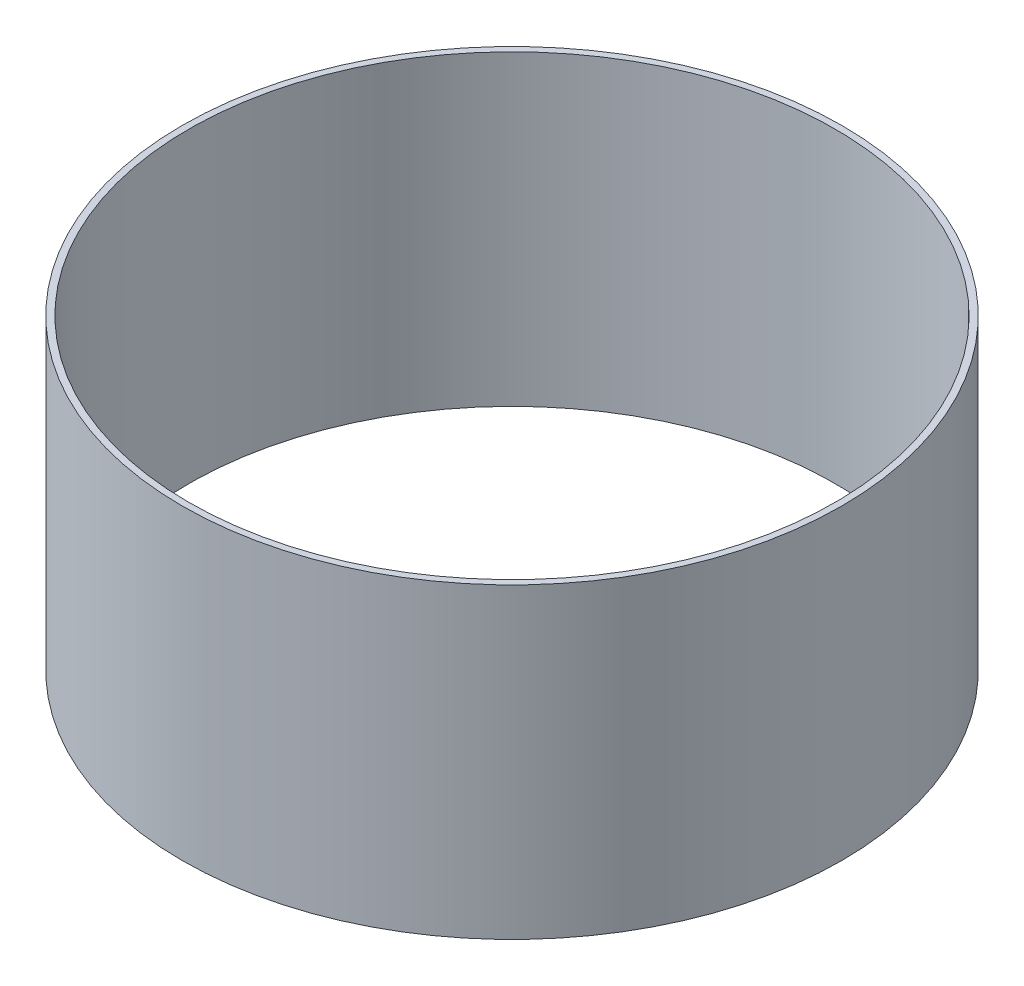
ISO-10303-21;
HEADER;
FILE_DESCRIPTION(('STEP AP214'),'2;1');
FILE_NAME('part.step','',(''),(''),'','','');
FILE_SCHEMA(('AUTOMOTIVE_DESIGN { 1 0 10303 214 1 1 1 1 }'));
ENDSEC;
DATA;
#1=APPLICATION_CONTEXT('core data for automotive mechanical design processes');
#2=APPLICATION_PROTOCOL_DEFINITION('international standard','automotive_design',2000,#1);
#3=PRODUCT_CONTEXT('',#1,'mechanical');
#4=PRODUCT('Part','Part','',(#3));
#5=PRODUCT_RELATED_PRODUCT_CATEGORY('part','',(#4));
#6=PRODUCT_DEFINITION_FORMATION('','',#4);
#7=PRODUCT_DEFINITION_CONTEXT('part definition',#1,'design');
#8=PRODUCT_DEFINITION('design','',#6,#7);
#9=PRODUCT_DEFINITION_SHAPE('','',#8);
#10=(LENGTH_UNIT() NAMED_UNIT(*) SI_UNIT(.MILLI.,.METRE.));
#11=(NAMED_UNIT(*) PLANE_ANGLE_UNIT() SI_UNIT($,.RADIAN.));
#12=(NAMED_UNIT(*) SI_UNIT($,.STERADIAN.) SOLID_ANGLE_UNIT());
#13=UNCERTAINTY_MEASURE_WITH_UNIT(LENGTH_MEASURE(1.E-05),#10,'distance_accuracy_value','');
#14=(GEOMETRIC_REPRESENTATION_CONTEXT(3) GLOBAL_UNCERTAINTY_ASSIGNED_CONTEXT((#13)) GLOBAL_UNIT_ASSIGNED_CONTEXT((#10,
#11,#12)) REPRESENTATION_CONTEXT('',''));
#15=CARTESIAN_POINT('',(0.,0.,0.));
#16=DIRECTION('',(0.,0.,1.));
#17=DIRECTION('',(1.,0.,0.));
#18=AXIS2_PLACEMENT_3D('',#15,#16,#17);
#19=CARTESIAN_POINT('',(0.,1603.70174894829,0.));
#20=DIRECTION('',(0.,1.,0.));
#21=DIRECTION('',(0.,0.,1.));
#22=AXIS2_PLACEMENT_3D('',#19,#20,#21);
#23=CYLINDRICAL_SURFACE('',#22,102.);
#24=CARTESIAN_POINT('',(0.,1603.70174894829,0.));
#25=DIRECTION('',(0.,1.,0.));
#26=DIRECTION('',(0.,0.,1.));
#27=AXIS2_PLACEMENT_3D('',#24,#25,#26);
#28=CIRCLE('',#27,102.);
#29=CARTESIAN_POINT('',(0.,1603.70174894829,102.));
#30=VERTEX_POINT('',#29);
#31=EDGE_CURVE('E10',#30,#30,#28,.T.);
#32=ORIENTED_EDGE('',*,*,#31,.T.);
#33=EDGE_LOOP('',(#32));
#34=FACE_BOUND('',#33,.T.);
#35=CARTESIAN_POINT('',(0.,1698.70174894829,0.));
#36=DIRECTION('',(0.,1.,0.));
#37=DIRECTION('',(0.,0.,1.));
#38=AXIS2_PLACEMENT_3D('',#35,#36,#37);
#39=CIRCLE('',#38,102.);
#40=CARTESIAN_POINT('',(0.,1698.70174894829,102.));
#41=VERTEX_POINT('',#40);
#42=EDGE_CURVE('E42',#41,#41,#39,.T.);
#43=ORIENTED_EDGE('',*,*,#42,.F.);
#44=EDGE_LOOP('',(#43));
#45=FACE_BOUND('',#44,.T.);
#46=ADVANCED_FACE('F39',(#34,#45),#23,.T.);
#47=CARTESIAN_POINT('',(0.,1603.70174894829,0.));
#48=DIRECTION('',(0.,1.,0.));
#49=DIRECTION('',(0.,0.,1.));
#50=AXIS2_PLACEMENT_3D('',#47,#48,#49);
#51=PLANE('',#50);
#52=CARTESIAN_POINT('',(0.,1603.70174894829,0.));
#53=DIRECTION('',(0.,1.,0.));
#54=DIRECTION('',(0.,0.,1.));
#55=AXIS2_PLACEMENT_3D('',#52,#53,#54);
#56=CIRCLE('',#55,100.);
#57=CARTESIAN_POINT('',(0.,1603.70174894829,100.));
#58=VERTEX_POINT('',#57);
#59=EDGE_CURVE('E49',#58,#58,#56,.T.);
#60=ORIENTED_EDGE('',*,*,#59,.T.);
#61=EDGE_LOOP('',(#60));
#62=FACE_BOUND('',#61,.T.);
#63=ORIENTED_EDGE('',*,*,#31,.F.);
#64=EDGE_LOOP('',(#63));
#65=FACE_BOUND('',#64,.T.);
#66=ADVANCED_FACE('F57',(#62,#65),#51,.F.);
#67=CARTESIAN_POINT('',(0.,1698.70174894829,0.));
#68=DIRECTION('',(0.,1.,0.));
#69=DIRECTION('',(0.,0.,1.));
#70=AXIS2_PLACEMENT_3D('',#67,#68,#69);
#71=PLANE('',#70);
#72=CARTESIAN_POINT('',(0.,1698.70174894829,0.));
#73=DIRECTION('',(0.,1.,0.));
#74=DIRECTION('',(0.,0.,1.));
#75=AXIS2_PLACEMENT_3D('',#72,#73,#74);
#76=CIRCLE('',#75,100.);
#77=CARTESIAN_POINT('',(0.,1698.70174894829,100.));
#78=VERTEX_POINT('',#77);
#79=EDGE_CURVE('E51',#78,#78,#76,.T.);
#80=ORIENTED_EDGE('',*,*,#79,.F.);
#81=EDGE_LOOP('',(#80));
#82=FACE_BOUND('',#81,.T.);
#83=ORIENTED_EDGE('',*,*,#42,.T.);
#84=EDGE_LOOP('',(#83));
#85=FACE_BOUND('',#84,.T.);
#86=ADVANCED_FACE('F63',(#82,#85),#71,.T.);
#87=CARTESIAN_POINT('',(0.,1603.70174894829,0.));
#88=DIRECTION('',(0.,1.,0.));
#89=DIRECTION('',(0.,0.,1.));
#90=AXIS2_PLACEMENT_3D('',#87,#88,#89);
#91=CYLINDRICAL_SURFACE('',#90,100.);
#92=ORIENTED_EDGE('',*,*,#59,.F.);
#93=EDGE_LOOP('',(#92));
#94=FACE_BOUND('',#93,.T.);
#95=ORIENTED_EDGE('',*,*,#79,.T.);
#96=EDGE_LOOP('',(#95));
#97=FACE_BOUND('',#96,.T.);
#98=ADVANCED_FACE('F60',(#94,#97),#91,.F.);
#99=CLOSED_SHELL('',(#46,#66,#86,#98));
#100=MANIFOLD_SOLID_BREP('B2',#99);
#101=ADVANCED_BREP_SHAPE_REPRESENTATION('',(#18,#100),#14);
#102=SHAPE_DEFINITION_REPRESENTATION(#9,#101);
ENDSEC;
END-ISO-10303-21;
